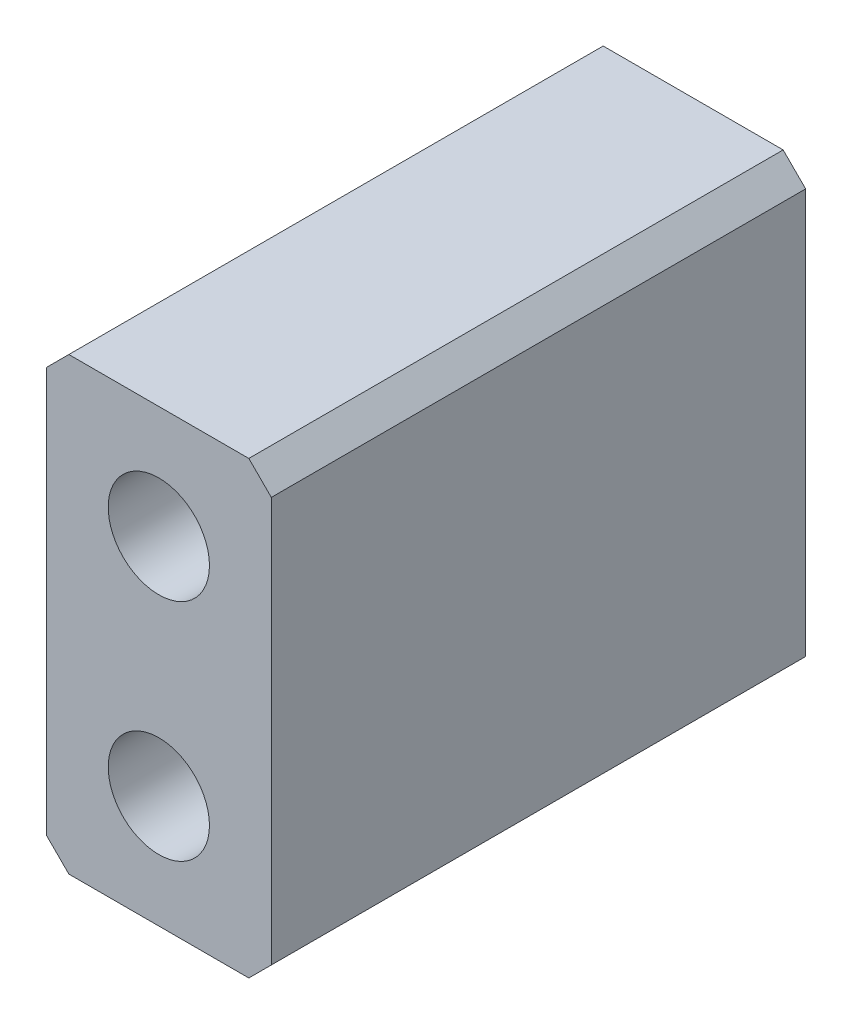
ISO-10303-21;
HEADER;
FILE_DESCRIPTION(('STEP AP214'),'2;1');
FILE_NAME('part.step','',(''),(''),'','','');
FILE_SCHEMA(('AUTOMOTIVE_DESIGN { 1 0 10303 214 1 1 1 1 }'));
ENDSEC;
DATA;
#1=APPLICATION_CONTEXT('core data for automotive mechanical design processes');
#2=APPLICATION_PROTOCOL_DEFINITION('international standard','automotive_design',2000,#1);
#3=PRODUCT_CONTEXT('',#1,'mechanical');
#4=PRODUCT('Part','Part','',(#3));
#5=PRODUCT_RELATED_PRODUCT_CATEGORY('part','',(#4));
#6=PRODUCT_DEFINITION_FORMATION('','',#4);
#7=PRODUCT_DEFINITION_CONTEXT('part definition',#1,'design');
#8=PRODUCT_DEFINITION('design','',#6,#7);
#9=PRODUCT_DEFINITION_SHAPE('','',#8);
#10=(LENGTH_UNIT() NAMED_UNIT(*) SI_UNIT(.MILLI.,.METRE.));
#11=(NAMED_UNIT(*) PLANE_ANGLE_UNIT() SI_UNIT($,.RADIAN.));
#12=(NAMED_UNIT(*) SI_UNIT($,.STERADIAN.) SOLID_ANGLE_UNIT());
#13=UNCERTAINTY_MEASURE_WITH_UNIT(LENGTH_MEASURE(1.E-05),#10,'distance_accuracy_value','');
#14=(GEOMETRIC_REPRESENTATION_CONTEXT(3) GLOBAL_UNCERTAINTY_ASSIGNED_CONTEXT((#13)) GLOBAL_UNIT_ASSIGNED_CONTEXT((#10,
#11,#12)) REPRESENTATION_CONTEXT('',''));
#15=CARTESIAN_POINT('',(0.,0.,0.));
#16=DIRECTION('',(0.,0.,1.));
#17=DIRECTION('',(1.,0.,0.));
#18=AXIS2_PLACEMENT_3D('',#15,#16,#17);
#19=CARTESIAN_POINT('',(0.,0.,47.5));
#20=DIRECTION('',(0.,0.,1.));
#21=DIRECTION('',(1.,0.,0.));
#22=AXIS2_PLACEMENT_3D('',#19,#20,#21);
#23=PLANE('',#22);
#24=CARTESIAN_POINT('',(0.,10.,47.5));
#25=DIRECTION('',(0.,0.,1.));
#26=DIRECTION('',(1.,0.,0.));
#27=AXIS2_PLACEMENT_3D('',#24,#25,#26);
#28=CIRCLE('',#27,4.5);
#29=CARTESIAN_POINT('',(4.5,10.,47.5));
#30=VERTEX_POINT('',#29);
#31=EDGE_CURVE('E169',#30,#30,#28,.T.);
#32=ORIENTED_EDGE('',*,*,#31,.F.);
#33=EDGE_LOOP('',(#32));
#34=FACE_BOUND('',#33,.T.);
#35=DIRECTION('',(-1.,0.,0.));
#36=VECTOR('',#35,1.);
#37=CARTESIAN_POINT('',(-10.,20.,47.5));
#38=LINE('',#37,#36);
#39=CARTESIAN_POINT('',(8.,20.,47.5));
#40=VERTEX_POINT('',#39);
#41=CARTESIAN_POINT('',(-7.99999999999999,20.,47.5));
#42=VERTEX_POINT('',#41);
#43=EDGE_CURVE('E135',#40,#42,#38,.T.);
#44=ORIENTED_EDGE('',*,*,#43,.T.);
#45=DIRECTION('',(0.707106781186549,0.707106781186546,0.));
#46=VECTOR('',#45,1.);
#47=CARTESIAN_POINT('',(-14.,14.,47.5));
#48=LINE('',#47,#46);
#49=CARTESIAN_POINT('',(-10.,18.,47.5));
#50=VERTEX_POINT('',#49);
#51=EDGE_CURVE('E160',#42,#50,#48,.F.);
#52=ORIENTED_EDGE('',*,*,#51,.T.);
#53=DIRECTION('',(0.,-1.,0.));
#54=VECTOR('',#53,1.);
#55=CARTESIAN_POINT('',(-10.,20.,47.5));
#56=LINE('',#55,#54);
#57=CARTESIAN_POINT('',(-9.99999999999999,-18.,47.5));
#58=VERTEX_POINT('',#57);
#59=EDGE_CURVE('E177',#50,#58,#56,.T.);
#60=ORIENTED_EDGE('',*,*,#59,.T.);
#61=DIRECTION('',(-0.707106781186546,0.707106781186549,0.));
#62=VECTOR('',#61,1.);
#63=CARTESIAN_POINT('',(-14.,-14.,47.5));
#64=LINE('',#63,#62);
#65=CARTESIAN_POINT('',(-7.99999999999999,-20.,47.5));
#66=VERTEX_POINT('',#65);
#67=EDGE_CURVE('E142',#58,#66,#64,.F.);
#68=ORIENTED_EDGE('',*,*,#67,.T.);
#69=DIRECTION('',(1.,0.,0.));
#70=VECTOR('',#69,1.);
#71=CARTESIAN_POINT('',(-9.99999999999999,-20.,47.5));
#72=LINE('',#71,#70);
#73=CARTESIAN_POINT('',(7.99999999999999,-20.,47.5));
#74=VERTEX_POINT('',#73);
#75=EDGE_CURVE('E126',#66,#74,#72,.T.);
#76=ORIENTED_EDGE('',*,*,#75,.T.);
#77=DIRECTION('',(-0.707106781186549,-0.707106781186546,0.));
#78=VECTOR('',#77,1.);
#79=CARTESIAN_POINT('',(14.,-14.,47.5));
#80=LINE('',#79,#78);
#81=CARTESIAN_POINT('',(10.,-18.,47.5));
#82=VERTEX_POINT('',#81);
#83=EDGE_CURVE('E64',#74,#82,#80,.F.);
#84=ORIENTED_EDGE('',*,*,#83,.T.);
#85=DIRECTION('',(0.,1.,0.));
#86=VECTOR('',#85,1.);
#87=CARTESIAN_POINT('',(10.,20.,47.5));
#88=LINE('',#87,#86);
#89=CARTESIAN_POINT('',(10.,18.,47.5));
#90=VERTEX_POINT('',#89);
#91=EDGE_CURVE('E132',#82,#90,#88,.T.);
#92=ORIENTED_EDGE('',*,*,#91,.T.);
#93=DIRECTION('',(0.707106781186546,-0.707106781186549,0.));
#94=VECTOR('',#93,1.);
#95=CARTESIAN_POINT('',(14.,14.,47.5));
#96=LINE('',#95,#94);
#97=EDGE_CURVE('E158',#90,#40,#96,.F.);
#98=ORIENTED_EDGE('',*,*,#97,.T.);
#99=EDGE_LOOP('',(#44,#52,#60,#68,#76,#84,#92,#98));
#100=FACE_BOUND('',#99,.T.);
#101=CARTESIAN_POINT('',(0.,-10.,47.5));
#102=DIRECTION('',(0.,0.,1.));
#103=DIRECTION('',(1.,0.,0.));
#104=AXIS2_PLACEMENT_3D('',#101,#102,#103);
#105=CIRCLE('',#104,4.5);
#106=CARTESIAN_POINT('',(4.5,-10.,47.5));
#107=VERTEX_POINT('',#106);
#108=EDGE_CURVE('E182',#107,#107,#105,.T.);
#109=ORIENTED_EDGE('',*,*,#108,.F.);
#110=EDGE_LOOP('',(#109));
#111=FACE_BOUND('',#110,.T.);
#112=ADVANCED_FACE('F42',(#34,#100,#111),#23,.T.);
#113=CARTESIAN_POINT('',(0.,0.,0.));
#114=DIRECTION('',(0.,0.,1.));
#115=DIRECTION('',(1.,0.,0.));
#116=AXIS2_PLACEMENT_3D('',#113,#114,#115);
#117=PLANE('',#116);
#118=DIRECTION('',(0.,-1.,0.));
#119=VECTOR('',#118,1.);
#120=CARTESIAN_POINT('',(-10.,20.,0.));
#121=LINE('',#120,#119);
#122=CARTESIAN_POINT('',(-10.,18.,0.));
#123=VERTEX_POINT('',#122);
#124=CARTESIAN_POINT('',(-9.99999999999999,-18.,0.));
#125=VERTEX_POINT('',#124);
#126=EDGE_CURVE('E133',#123,#125,#121,.T.);
#127=ORIENTED_EDGE('',*,*,#126,.F.);
#128=DIRECTION('',(-0.707106781186549,-0.707106781186546,0.));
#129=VECTOR('',#128,1.);
#130=CARTESIAN_POINT('',(-10.,18.,0.));
#131=LINE('',#130,#129);
#132=CARTESIAN_POINT('',(-7.99999999999999,20.,0.));
#133=VERTEX_POINT('',#132);
#134=EDGE_CURVE('E150',#123,#133,#131,.F.);
#135=ORIENTED_EDGE('',*,*,#134,.T.);
#136=DIRECTION('',(-1.,0.,0.));
#137=VECTOR('',#136,1.);
#138=CARTESIAN_POINT('',(-10.,20.,0.));
#139=LINE('',#138,#137);
#140=CARTESIAN_POINT('',(8.,20.,0.));
#141=VERTEX_POINT('',#140);
#142=EDGE_CURVE('E137',#141,#133,#139,.T.);
#143=ORIENTED_EDGE('',*,*,#142,.F.);
#144=DIRECTION('',(-0.707106781186546,0.707106781186549,0.));
#145=VECTOR('',#144,1.);
#146=CARTESIAN_POINT('',(8.,20.,0.));
#147=LINE('',#146,#145);
#148=CARTESIAN_POINT('',(10.,18.,0.));
#149=VERTEX_POINT('',#148);
#150=EDGE_CURVE('E148',#141,#149,#147,.F.);
#151=ORIENTED_EDGE('',*,*,#150,.T.);
#152=DIRECTION('',(0.,1.,0.));
#153=VECTOR('',#152,1.);
#154=CARTESIAN_POINT('',(10.,20.,0.));
#155=LINE('',#154,#153);
#156=CARTESIAN_POINT('',(10.,-18.,0.));
#157=VERTEX_POINT('',#156);
#158=EDGE_CURVE('E166',#157,#149,#155,.T.);
#159=ORIENTED_EDGE('',*,*,#158,.F.);
#160=DIRECTION('',(0.707106781186549,0.707106781186546,0.));
#161=VECTOR('',#160,1.);
#162=CARTESIAN_POINT('',(10.,-18.,0.));
#163=LINE('',#162,#161);
#164=CARTESIAN_POINT('',(7.99999999999999,-20.,0.));
#165=VERTEX_POINT('',#164);
#166=EDGE_CURVE('E131',#157,#165,#163,.F.);
#167=ORIENTED_EDGE('',*,*,#166,.T.);
#168=DIRECTION('',(1.,0.,0.));
#169=VECTOR('',#168,1.);
#170=CARTESIAN_POINT('',(-9.99999999999999,-20.,0.));
#171=LINE('',#170,#169);
#172=CARTESIAN_POINT('',(-7.99999999999999,-20.,0.));
#173=VERTEX_POINT('',#172);
#174=EDGE_CURVE('E124',#173,#165,#171,.T.);
#175=ORIENTED_EDGE('',*,*,#174,.F.);
#176=DIRECTION('',(0.707106781186546,-0.707106781186549,0.));
#177=VECTOR('',#176,1.);
#178=CARTESIAN_POINT('',(-7.99999999999999,-20.,0.));
#179=LINE('',#178,#177);
#180=EDGE_CURVE('E109',#173,#125,#179,.F.);
#181=ORIENTED_EDGE('',*,*,#180,.T.);
#182=EDGE_LOOP('',(#127,#135,#143,#151,#159,#167,#175,#181));
#183=FACE_BOUND('',#182,.T.);
#184=CARTESIAN_POINT('',(0.,10.,0.));
#185=DIRECTION('',(0.,0.,1.));
#186=DIRECTION('',(1.,0.,0.));
#187=AXIS2_PLACEMENT_3D('',#184,#185,#186);
#188=CIRCLE('',#187,4.5);
#189=CARTESIAN_POINT('',(4.5,10.,0.));
#190=VERTEX_POINT('',#189);
#191=EDGE_CURVE('E173',#190,#190,#188,.T.);
#192=ORIENTED_EDGE('',*,*,#191,.T.);
#193=EDGE_LOOP('',(#192));
#194=FACE_BOUND('',#193,.T.);
#195=CARTESIAN_POINT('',(0.,-10.,0.));
#196=DIRECTION('',(0.,0.,1.));
#197=DIRECTION('',(1.,0.,0.));
#198=AXIS2_PLACEMENT_3D('',#195,#196,#197);
#199=CIRCLE('',#198,4.5);
#200=CARTESIAN_POINT('',(4.5,-10.,0.));
#201=VERTEX_POINT('',#200);
#202=EDGE_CURVE('E184',#201,#201,#199,.T.);
#203=ORIENTED_EDGE('',*,*,#202,.T.);
#204=EDGE_LOOP('',(#203));
#205=FACE_BOUND('',#204,.T.);
#206=ADVANCED_FACE('F128',(#183,#194,#205),#117,.F.);
#207=CARTESIAN_POINT('',(10.,20.,47.5));
#208=DIRECTION('',(-1.,0.,0.));
#209=DIRECTION('',(0.,-1.,0.));
#210=AXIS2_PLACEMENT_3D('',#207,#208,#209);
#211=PLANE('',#210);
#212=ORIENTED_EDGE('',*,*,#158,.T.);
#213=DIRECTION('',(0.,0.,1.));
#214=VECTOR('',#213,1.);
#215=CARTESIAN_POINT('',(10.,18.,47.5));
#216=LINE('',#215,#214);
#217=EDGE_CURVE('E51',#149,#90,#216,.T.);
#218=ORIENTED_EDGE('',*,*,#217,.T.);
#219=ORIENTED_EDGE('',*,*,#91,.F.);
#220=DIRECTION('',(0.,0.,-1.));
#221=VECTOR('',#220,1.);
#222=CARTESIAN_POINT('',(10.,-18.,47.5));
#223=LINE('',#222,#221);
#224=EDGE_CURVE('E162',#82,#157,#223,.T.);
#225=ORIENTED_EDGE('',*,*,#224,.T.);
#226=EDGE_LOOP('',(#212,#218,#219,#225));
#227=FACE_BOUND('',#226,.T.);
#228=ADVANCED_FACE('F165',(#227),#211,.F.);
#229=CARTESIAN_POINT('',(-10.,20.,47.5));
#230=DIRECTION('',(0.,-1.,0.));
#231=DIRECTION('',(1.,0.,0.));
#232=AXIS2_PLACEMENT_3D('',#229,#230,#231);
#233=PLANE('',#232);
#234=ORIENTED_EDGE('',*,*,#142,.T.);
#235=DIRECTION('',(0.,0.,1.));
#236=VECTOR('',#235,1.);
#237=CARTESIAN_POINT('',(-7.99999999999999,20.,47.5));
#238=LINE('',#237,#236);
#239=EDGE_CURVE('E155',#133,#42,#238,.T.);
#240=ORIENTED_EDGE('',*,*,#239,.T.);
#241=ORIENTED_EDGE('',*,*,#43,.F.);
#242=DIRECTION('',(0.,0.,-1.));
#243=VECTOR('',#242,1.);
#244=CARTESIAN_POINT('',(8.,20.,47.5));
#245=LINE('',#244,#243);
#246=EDGE_CURVE('E152',#40,#141,#245,.T.);
#247=ORIENTED_EDGE('',*,*,#246,.T.);
#248=EDGE_LOOP('',(#234,#240,#241,#247));
#249=FACE_BOUND('',#248,.T.);
#250=ADVANCED_FACE('F210',(#249),#233,.F.);
#251=CARTESIAN_POINT('',(-10.,20.,47.5));
#252=DIRECTION('',(1.,0.,0.));
#253=DIRECTION('',(0.,1.,0.));
#254=AXIS2_PLACEMENT_3D('',#251,#252,#253);
#255=PLANE('',#254);
#256=ORIENTED_EDGE('',*,*,#59,.F.);
#257=DIRECTION('',(0.,0.,-1.));
#258=VECTOR('',#257,1.);
#259=CARTESIAN_POINT('',(-10.,18.,47.5));
#260=LINE('',#259,#258);
#261=EDGE_CURVE('E144',#50,#123,#260,.T.);
#262=ORIENTED_EDGE('',*,*,#261,.T.);
#263=ORIENTED_EDGE('',*,*,#126,.T.);
#264=DIRECTION('',(0.,0.,1.));
#265=VECTOR('',#264,1.);
#266=CARTESIAN_POINT('',(-9.99999999999999,-18.,47.5));
#267=LINE('',#266,#265);
#268=EDGE_CURVE('E115',#125,#58,#267,.T.);
#269=ORIENTED_EDGE('',*,*,#268,.T.);
#270=EDGE_LOOP('',(#256,#262,#263,#269));
#271=FACE_BOUND('',#270,.T.);
#272=ADVANCED_FACE('F207',(#271),#255,.F.);
#273=CARTESIAN_POINT('',(-9.99999999999999,-20.,47.5));
#274=DIRECTION('',(0.,1.,0.));
#275=DIRECTION('',(0.,0.,1.));
#276=AXIS2_PLACEMENT_3D('',#273,#274,#275);
#277=PLANE('',#276);
#278=ORIENTED_EDGE('',*,*,#174,.T.);
#279=DIRECTION('',(0.,0.,1.));
#280=VECTOR('',#279,1.);
#281=CARTESIAN_POINT('',(7.99999999999999,-20.,47.5));
#282=LINE('',#281,#280);
#283=EDGE_CURVE('E11',#165,#74,#282,.T.);
#284=ORIENTED_EDGE('',*,*,#283,.T.);
#285=ORIENTED_EDGE('',*,*,#75,.F.);
#286=DIRECTION('',(0.,0.,-1.));
#287=VECTOR('',#286,1.);
#288=CARTESIAN_POINT('',(-7.99999999999999,-20.,47.5));
#289=LINE('',#288,#287);
#290=EDGE_CURVE('E113',#66,#173,#289,.T.);
#291=ORIENTED_EDGE('',*,*,#290,.T.);
#292=EDGE_LOOP('',(#278,#284,#285,#291));
#293=FACE_BOUND('',#292,.T.);
#294=ADVANCED_FACE('F123',(#293),#277,.F.);
#295=CARTESIAN_POINT('',(0.,10.,47.5));
#296=DIRECTION('',(0.,0.,-1.));
#297=DIRECTION('',(-1.,0.,0.));
#298=AXIS2_PLACEMENT_3D('',#295,#296,#297);
#299=CYLINDRICAL_SURFACE('',#298,4.5);
#300=ORIENTED_EDGE('',*,*,#31,.T.);
#301=EDGE_LOOP('',(#300));
#302=FACE_BOUND('',#301,.T.);
#303=ORIENTED_EDGE('',*,*,#191,.F.);
#304=EDGE_LOOP('',(#303));
#305=FACE_BOUND('',#304,.T.);
#306=ADVANCED_FACE('F202',(#302,#305),#299,.F.);
#307=CARTESIAN_POINT('',(0.,-10.,47.5));
#308=DIRECTION('',(0.,0.,-1.));
#309=DIRECTION('',(-1.,0.,0.));
#310=AXIS2_PLACEMENT_3D('',#307,#308,#309);
#311=CYLINDRICAL_SURFACE('',#310,4.5);
#312=ORIENTED_EDGE('',*,*,#108,.T.);
#313=EDGE_LOOP('',(#312));
#314=FACE_BOUND('',#313,.T.);
#315=ORIENTED_EDGE('',*,*,#202,.F.);
#316=EDGE_LOOP('',(#315));
#317=FACE_BOUND('',#316,.T.);
#318=ADVANCED_FACE('F190',(#314,#317),#311,.F.);
#319=CARTESIAN_POINT('',(-7.99999999999999,-20.,47.5));
#320=DIRECTION('',(0.707106781186549,0.707106781186546,0.));
#321=DIRECTION('',(0.,0.,-1.));
#322=AXIS2_PLACEMENT_3D('',#319,#320,#321);
#323=PLANE('',#322);
#324=ORIENTED_EDGE('',*,*,#67,.F.);
#325=ORIENTED_EDGE('',*,*,#268,.F.);
#326=ORIENTED_EDGE('',*,*,#180,.F.);
#327=ORIENTED_EDGE('',*,*,#290,.F.);
#328=EDGE_LOOP('',(#324,#325,#326,#327));
#329=FACE_BOUND('',#328,.T.);
#330=ADVANCED_FACE('F112',(#329),#323,.F.);
#331=CARTESIAN_POINT('',(-10.,18.,47.5));
#332=DIRECTION('',(0.707106781186546,-0.707106781186549,0.));
#333=DIRECTION('',(0.,0.,-1.));
#334=AXIS2_PLACEMENT_3D('',#331,#332,#333);
#335=PLANE('',#334);
#336=ORIENTED_EDGE('',*,*,#51,.F.);
#337=ORIENTED_EDGE('',*,*,#239,.F.);
#338=ORIENTED_EDGE('',*,*,#134,.F.);
#339=ORIENTED_EDGE('',*,*,#261,.F.);
#340=EDGE_LOOP('',(#336,#337,#338,#339));
#341=FACE_BOUND('',#340,.T.);
#342=ADVANCED_FACE('F223',(#341),#335,.F.);
#343=CARTESIAN_POINT('',(8.,20.,47.5));
#344=DIRECTION('',(-0.707106781186549,-0.707106781186546,0.));
#345=DIRECTION('',(0.,0.,-1.));
#346=AXIS2_PLACEMENT_3D('',#343,#344,#345);
#347=PLANE('',#346);
#348=ORIENTED_EDGE('',*,*,#97,.F.);
#349=ORIENTED_EDGE('',*,*,#217,.F.);
#350=ORIENTED_EDGE('',*,*,#150,.F.);
#351=ORIENTED_EDGE('',*,*,#246,.F.);
#352=EDGE_LOOP('',(#348,#349,#350,#351));
#353=FACE_BOUND('',#352,.T.);
#354=ADVANCED_FACE('F228',(#353),#347,.F.);
#355=CARTESIAN_POINT('',(10.,-18.,47.5));
#356=DIRECTION('',(-0.707106781186546,0.707106781186549,0.));
#357=DIRECTION('',(0.,0.,-1.));
#358=AXIS2_PLACEMENT_3D('',#355,#356,#357);
#359=PLANE('',#358);
#360=ORIENTED_EDGE('',*,*,#83,.F.);
#361=ORIENTED_EDGE('',*,*,#283,.F.);
#362=ORIENTED_EDGE('',*,*,#166,.F.);
#363=ORIENTED_EDGE('',*,*,#224,.F.);
#364=EDGE_LOOP('',(#360,#361,#362,#363));
#365=FACE_BOUND('',#364,.T.);
#366=ADVANCED_FACE('F45',(#365),#359,.F.);
#367=CLOSED_SHELL('',(#112,#206,#228,#250,#272,#294,#306,#318,#330,#342,#354,#366));
#368=MANIFOLD_SOLID_BREP('B2',#367);
#369=ADVANCED_BREP_SHAPE_REPRESENTATION('',(#18,#368),#14);
#370=SHAPE_DEFINITION_REPRESENTATION(#9,#369);
ENDSEC;
END-ISO-10303-21;
